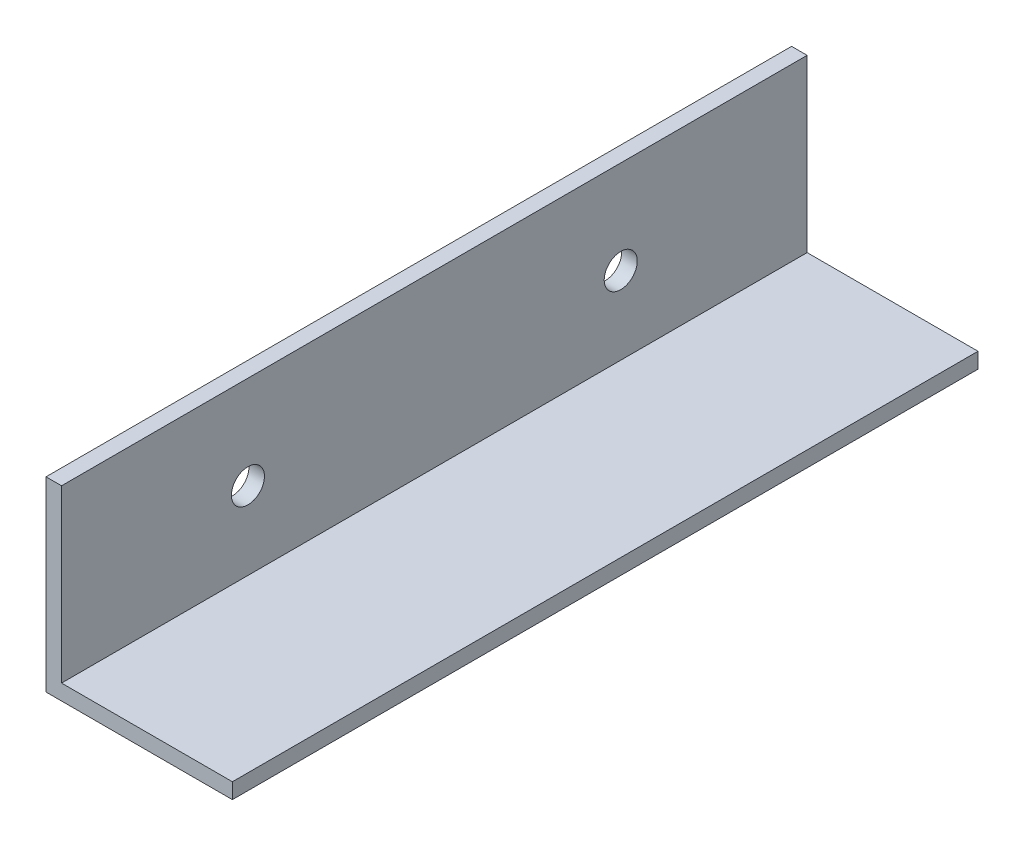
ISO-10303-21;
HEADER;
FILE_DESCRIPTION(('STEP AP214'),'2;1');
FILE_NAME('part.step','',(''),(''),'','','');
FILE_SCHEMA(('AUTOMOTIVE_DESIGN { 1 0 10303 214 1 1 1 1 }'));
ENDSEC;
DATA;
#1=APPLICATION_CONTEXT('core data for automotive mechanical design processes');
#2=APPLICATION_PROTOCOL_DEFINITION('international standard','automotive_design',2000,#1);
#3=PRODUCT_CONTEXT('',#1,'mechanical');
#4=PRODUCT('Part','Part','',(#3));
#5=PRODUCT_RELATED_PRODUCT_CATEGORY('part','',(#4));
#6=PRODUCT_DEFINITION_FORMATION('','',#4);
#7=PRODUCT_DEFINITION_CONTEXT('part definition',#1,'design');
#8=PRODUCT_DEFINITION('design','',#6,#7);
#9=PRODUCT_DEFINITION_SHAPE('','',#8);
#10=(LENGTH_UNIT() NAMED_UNIT(*) SI_UNIT(.MILLI.,.METRE.));
#11=(NAMED_UNIT(*) PLANE_ANGLE_UNIT() SI_UNIT($,.RADIAN.));
#12=(NAMED_UNIT(*) SI_UNIT($,.STERADIAN.) SOLID_ANGLE_UNIT());
#13=UNCERTAINTY_MEASURE_WITH_UNIT(LENGTH_MEASURE(1.E-05),#10,'distance_accuracy_value','');
#14=(GEOMETRIC_REPRESENTATION_CONTEXT(3) GLOBAL_UNCERTAINTY_ASSIGNED_CONTEXT((#13)) GLOBAL_UNIT_ASSIGNED_CONTEXT((#10,
#11,#12)) REPRESENTATION_CONTEXT('',''));
#15=CARTESIAN_POINT('',(0.,0.,0.));
#16=DIRECTION('',(0.,0.,1.));
#17=DIRECTION('',(1.,0.,0.));
#18=AXIS2_PLACEMENT_3D('',#15,#16,#17);
#19=CARTESIAN_POINT('',(0.,0.,152.4));
#20=DIRECTION('',(1.,0.,0.));
#21=DIRECTION('',(0.,0.,-1.));
#22=AXIS2_PLACEMENT_3D('',#19,#20,#21);
#23=PLANE('',#22);
#24=CARTESIAN_POINT('',(0.,19.05,38.1));
#25=DIRECTION('',(-1.,0.,0.));
#26=DIRECTION('',(0.,0.,1.));
#27=AXIS2_PLACEMENT_3D('',#24,#25,#26);
#28=CIRCLE('',#27,3.37819999999999);
#29=CARTESIAN_POINT('',(0.,19.05,41.4782));
#30=VERTEX_POINT('',#29);
#31=EDGE_CURVE('E157',#30,#30,#28,.T.);
#32=ORIENTED_EDGE('',*,*,#31,.F.);
#33=EDGE_LOOP('',(#32));
#34=FACE_BOUND('',#33,.T.);
#35=DIRECTION('',(0.,-1.,0.));
#36=VECTOR('',#35,1.);
#37=CARTESIAN_POINT('',(0.,0.,0.));
#38=LINE('',#37,#36);
#39=CARTESIAN_POINT('',(0.,38.1,0.));
#40=VERTEX_POINT('',#39);
#41=CARTESIAN_POINT('',(0.,0.,0.));
#42=VERTEX_POINT('',#41);
#43=EDGE_CURVE('E81',#40,#42,#38,.T.);
#44=ORIENTED_EDGE('',*,*,#43,.T.);
#45=DIRECTION('',(0.,0.,-1.));
#46=VECTOR('',#45,1.);
#47=CARTESIAN_POINT('',(0.,0.,152.4));
#48=LINE('',#47,#46);
#49=CARTESIAN_POINT('',(0.,0.,152.4));
#50=VERTEX_POINT('',#49);
#51=EDGE_CURVE('E116',#50,#42,#48,.T.);
#52=ORIENTED_EDGE('',*,*,#51,.F.);
#53=DIRECTION('',(0.,-1.,0.));
#54=VECTOR('',#53,1.);
#55=CARTESIAN_POINT('',(0.,0.,152.4));
#56=LINE('',#55,#54);
#57=CARTESIAN_POINT('',(0.,38.1,152.4));
#58=VERTEX_POINT('',#57);
#59=EDGE_CURVE('E52',#58,#50,#56,.T.);
#60=ORIENTED_EDGE('',*,*,#59,.F.);
#61=DIRECTION('',(0.,0.,-1.));
#62=VECTOR('',#61,1.);
#63=CARTESIAN_POINT('',(0.,38.1,152.4));
#64=LINE('',#63,#62);
#65=EDGE_CURVE('E112',#58,#40,#64,.T.);
#66=ORIENTED_EDGE('',*,*,#65,.T.);
#67=EDGE_LOOP('',(#44,#52,#60,#66));
#68=FACE_BOUND('',#67,.T.);
#69=CARTESIAN_POINT('',(0.,19.05,114.3));
#70=DIRECTION('',(-1.,0.,0.));
#71=DIRECTION('',(0.,0.,1.));
#72=AXIS2_PLACEMENT_3D('',#69,#70,#71);
#73=CIRCLE('',#72,3.37819999999999);
#74=CARTESIAN_POINT('',(0.,19.05,117.6782));
#75=VERTEX_POINT('',#74);
#76=EDGE_CURVE('E151',#75,#75,#73,.T.);
#77=ORIENTED_EDGE('',*,*,#76,.F.);
#78=EDGE_LOOP('',(#77));
#79=FACE_BOUND('',#78,.T.);
#80=ADVANCED_FACE('F34',(#34,#68,#79),#23,.F.);
#81=CARTESIAN_POINT('',(38.1,0.,152.4));
#82=DIRECTION('',(0.,1.,0.));
#83=DIRECTION('',(-1.,0.,0.));
#84=AXIS2_PLACEMENT_3D('',#81,#82,#83);
#85=PLANE('',#84);
#86=DIRECTION('',(1.,0.,0.));
#87=VECTOR('',#86,1.);
#88=CARTESIAN_POINT('',(38.1,0.,0.));
#89=LINE('',#88,#87);
#90=CARTESIAN_POINT('',(38.1,0.,0.));
#91=VERTEX_POINT('',#90);
#92=EDGE_CURVE('E120',#42,#91,#89,.T.);
#93=ORIENTED_EDGE('',*,*,#92,.T.);
#94=DIRECTION('',(0.,0.,-1.));
#95=VECTOR('',#94,1.);
#96=CARTESIAN_POINT('',(38.1,0.,152.4));
#97=LINE('',#96,#95);
#98=CARTESIAN_POINT('',(38.1,0.,152.4));
#99=VERTEX_POINT('',#98);
#100=EDGE_CURVE('E11',#99,#91,#97,.T.);
#101=ORIENTED_EDGE('',*,*,#100,.F.);
#102=DIRECTION('',(1.,0.,0.));
#103=VECTOR('',#102,1.);
#104=CARTESIAN_POINT('',(38.1,0.,152.4));
#105=LINE('',#104,#103);
#106=EDGE_CURVE('E131',#50,#99,#105,.T.);
#107=ORIENTED_EDGE('',*,*,#106,.F.);
#108=ORIENTED_EDGE('',*,*,#51,.T.);
#109=EDGE_LOOP('',(#93,#101,#107,#108));
#110=FACE_BOUND('',#109,.T.);
#111=ADVANCED_FACE('F36',(#110),#85,.F.);
#112=CARTESIAN_POINT('',(38.1,3.175,152.4));
#113=DIRECTION('',(-1.,0.,0.));
#114=DIRECTION('',(0.,0.,1.));
#115=AXIS2_PLACEMENT_3D('',#112,#113,#114);
#116=PLANE('',#115);
#117=DIRECTION('',(0.,1.,0.));
#118=VECTOR('',#117,1.);
#119=CARTESIAN_POINT('',(38.1,3.175,0.));
#120=LINE('',#119,#118);
#121=CARTESIAN_POINT('',(38.1,3.175,0.));
#122=VERTEX_POINT('',#121);
#123=EDGE_CURVE('E123',#91,#122,#120,.T.);
#124=ORIENTED_EDGE('',*,*,#123,.T.);
#125=DIRECTION('',(0.,0.,-1.));
#126=VECTOR('',#125,1.);
#127=CARTESIAN_POINT('',(38.1,3.175,152.4));
#128=LINE('',#127,#126);
#129=CARTESIAN_POINT('',(38.1,3.175,152.4));
#130=VERTEX_POINT('',#129);
#131=EDGE_CURVE('E44',#130,#122,#128,.T.);
#132=ORIENTED_EDGE('',*,*,#131,.F.);
#133=DIRECTION('',(0.,1.,0.));
#134=VECTOR('',#133,1.);
#135=CARTESIAN_POINT('',(38.1,3.175,152.4));
#136=LINE('',#135,#134);
#137=EDGE_CURVE('E89',#99,#130,#136,.T.);
#138=ORIENTED_EDGE('',*,*,#137,.F.);
#139=ORIENTED_EDGE('',*,*,#100,.T.);
#140=EDGE_LOOP('',(#124,#132,#138,#139));
#141=FACE_BOUND('',#140,.T.);
#142=ADVANCED_FACE('F188',(#141),#116,.F.);
#143=CARTESIAN_POINT('',(3.17500000000001,3.175,152.4));
#144=DIRECTION('',(0.,-1.,0.));
#145=DIRECTION('',(0.,0.,-1.));
#146=AXIS2_PLACEMENT_3D('',#143,#144,#145);
#147=PLANE('',#146);
#148=DIRECTION('',(-1.,0.,0.));
#149=VECTOR('',#148,1.);
#150=CARTESIAN_POINT('',(3.17500000000001,3.175,0.));
#151=LINE('',#150,#149);
#152=CARTESIAN_POINT('',(3.17500000000001,3.175,0.));
#153=VERTEX_POINT('',#152);
#154=EDGE_CURVE('E126',#122,#153,#151,.T.);
#155=ORIENTED_EDGE('',*,*,#154,.T.);
#156=DIRECTION('',(0.,0.,-1.));
#157=VECTOR('',#156,1.);
#158=CARTESIAN_POINT('',(3.17500000000001,3.175,152.4));
#159=LINE('',#158,#157);
#160=CARTESIAN_POINT('',(3.17500000000001,3.175,152.4));
#161=VERTEX_POINT('',#160);
#162=EDGE_CURVE('E111',#161,#153,#159,.T.);
#163=ORIENTED_EDGE('',*,*,#162,.F.);
#164=DIRECTION('',(-1.,0.,0.));
#165=VECTOR('',#164,1.);
#166=CARTESIAN_POINT('',(3.17500000000001,3.175,152.4));
#167=LINE('',#166,#165);
#168=EDGE_CURVE('E102',#130,#161,#167,.T.);
#169=ORIENTED_EDGE('',*,*,#168,.F.);
#170=ORIENTED_EDGE('',*,*,#131,.T.);
#171=EDGE_LOOP('',(#155,#163,#169,#170));
#172=FACE_BOUND('',#171,.T.);
#173=ADVANCED_FACE('F138',(#172),#147,.F.);
#174=CARTESIAN_POINT('',(3.175,38.1,152.4));
#175=DIRECTION('',(-1.,0.,0.));
#176=DIRECTION('',(0.,-1.,0.));
#177=AXIS2_PLACEMENT_3D('',#174,#175,#176);
#178=PLANE('',#177);
#179=CARTESIAN_POINT('',(3.175,19.05,38.1));
#180=DIRECTION('',(-1.,0.,0.));
#181=DIRECTION('',(0.,-1.,0.));
#182=AXIS2_PLACEMENT_3D('',#179,#180,#181);
#183=CIRCLE('',#182,3.37819999999999);
#184=CARTESIAN_POINT('',(3.175,15.6718,38.1));
#185=VERTEX_POINT('',#184);
#186=EDGE_CURVE('E38',#185,#185,#183,.T.);
#187=ORIENTED_EDGE('',*,*,#186,.T.);
#188=EDGE_LOOP('',(#187));
#189=FACE_BOUND('',#188,.T.);
#190=CARTESIAN_POINT('',(3.175,19.05,114.3));
#191=DIRECTION('',(-1.,0.,0.));
#192=DIRECTION('',(0.,-1.,0.));
#193=AXIS2_PLACEMENT_3D('',#190,#191,#192);
#194=CIRCLE('',#193,3.37819999999999);
#195=CARTESIAN_POINT('',(3.175,15.6718,114.3));
#196=VERTEX_POINT('',#195);
#197=EDGE_CURVE('E124',#196,#196,#194,.T.);
#198=ORIENTED_EDGE('',*,*,#197,.T.);
#199=EDGE_LOOP('',(#198));
#200=FACE_BOUND('',#199,.T.);
#201=DIRECTION('',(0.,1.,0.));
#202=VECTOR('',#201,1.);
#203=CARTESIAN_POINT('',(3.175,38.1,0.));
#204=LINE('',#203,#202);
#205=CARTESIAN_POINT('',(3.175,38.1,0.));
#206=VERTEX_POINT('',#205);
#207=EDGE_CURVE('E110',#153,#206,#204,.T.);
#208=ORIENTED_EDGE('',*,*,#207,.T.);
#209=DIRECTION('',(0.,0.,-1.));
#210=VECTOR('',#209,1.);
#211=CARTESIAN_POINT('',(3.175,38.1,152.4));
#212=LINE('',#211,#210);
#213=CARTESIAN_POINT('',(3.175,38.1,152.4));
#214=VERTEX_POINT('',#213);
#215=EDGE_CURVE('E107',#214,#206,#212,.T.);
#216=ORIENTED_EDGE('',*,*,#215,.F.);
#217=DIRECTION('',(0.,1.,0.));
#218=VECTOR('',#217,1.);
#219=CARTESIAN_POINT('',(3.175,38.1,152.4));
#220=LINE('',#219,#218);
#221=EDGE_CURVE('E96',#161,#214,#220,.T.);
#222=ORIENTED_EDGE('',*,*,#221,.F.);
#223=ORIENTED_EDGE('',*,*,#162,.T.);
#224=EDGE_LOOP('',(#208,#216,#222,#223));
#225=FACE_BOUND('',#224,.T.);
#226=ADVANCED_FACE('F108',(#189,#200,#225),#178,.F.);
#227=CARTESIAN_POINT('',(0.,38.1,152.4));
#228=DIRECTION('',(0.,-1.,0.));
#229=DIRECTION('',(0.,0.,-1.));
#230=AXIS2_PLACEMENT_3D('',#227,#228,#229);
#231=PLANE('',#230);
#232=DIRECTION('',(-1.,0.,0.));
#233=VECTOR('',#232,1.);
#234=CARTESIAN_POINT('',(0.,38.1,0.));
#235=LINE('',#234,#233);
#236=EDGE_CURVE('E75',#206,#40,#235,.T.);
#237=ORIENTED_EDGE('',*,*,#236,.T.);
#238=ORIENTED_EDGE('',*,*,#65,.F.);
#239=DIRECTION('',(-1.,0.,0.));
#240=VECTOR('',#239,1.);
#241=CARTESIAN_POINT('',(0.,38.1,152.4));
#242=LINE('',#241,#240);
#243=EDGE_CURVE('E100',#214,#58,#242,.T.);
#244=ORIENTED_EDGE('',*,*,#243,.F.);
#245=ORIENTED_EDGE('',*,*,#215,.T.);
#246=EDGE_LOOP('',(#237,#238,#244,#245));
#247=FACE_BOUND('',#246,.T.);
#248=ADVANCED_FACE('F114',(#247),#231,.F.);
#249=CARTESIAN_POINT('',(0.,0.,152.4));
#250=DIRECTION('',(0.,0.,-1.));
#251=DIRECTION('',(-1.,0.,0.));
#252=AXIS2_PLACEMENT_3D('',#249,#250,#251);
#253=PLANE('',#252);
#254=ORIENTED_EDGE('',*,*,#106,.T.);
#255=ORIENTED_EDGE('',*,*,#137,.T.);
#256=ORIENTED_EDGE('',*,*,#168,.T.);
#257=ORIENTED_EDGE('',*,*,#221,.T.);
#258=ORIENTED_EDGE('',*,*,#243,.T.);
#259=ORIENTED_EDGE('',*,*,#59,.T.);
#260=EDGE_LOOP('',(#254,#255,#256,#257,#258,#259));
#261=FACE_BOUND('',#260,.T.);
#262=ADVANCED_FACE('F98',(#261),#253,.F.);
#263=CARTESIAN_POINT('',(0.,0.,0.));
#264=DIRECTION('',(0.,0.,-1.));
#265=DIRECTION('',(-1.,0.,0.));
#266=AXIS2_PLACEMENT_3D('',#263,#264,#265);
#267=PLANE('',#266);
#268=ORIENTED_EDGE('',*,*,#92,.F.);
#269=ORIENTED_EDGE('',*,*,#43,.F.);
#270=ORIENTED_EDGE('',*,*,#236,.F.);
#271=ORIENTED_EDGE('',*,*,#207,.F.);
#272=ORIENTED_EDGE('',*,*,#154,.F.);
#273=ORIENTED_EDGE('',*,*,#123,.F.);
#274=EDGE_LOOP('',(#268,#269,#270,#271,#272,#273));
#275=FACE_BOUND('',#274,.T.);
#276=ADVANCED_FACE('F141',(#275),#267,.T.);
#277=CARTESIAN_POINT('',(0.,19.05,114.3));
#278=DIRECTION('',(-1.,0.,0.));
#279=DIRECTION('',(0.,0.,1.));
#280=AXIS2_PLACEMENT_3D('',#277,#278,#279);
#281=CYLINDRICAL_SURFACE('',#280,3.37819999999999);
#282=ORIENTED_EDGE('',*,*,#76,.T.);
#283=EDGE_LOOP('',(#282));
#284=FACE_BOUND('',#283,.T.);
#285=ORIENTED_EDGE('',*,*,#197,.F.);
#286=EDGE_LOOP('',(#285));
#287=FACE_BOUND('',#286,.T.);
#288=ADVANCED_FACE('F167',(#284,#287),#281,.F.);
#289=CARTESIAN_POINT('',(0.,19.05,38.1));
#290=DIRECTION('',(-1.,0.,0.));
#291=DIRECTION('',(0.,0.,1.));
#292=AXIS2_PLACEMENT_3D('',#289,#290,#291);
#293=CYLINDRICAL_SURFACE('',#292,3.37819999999999);
#294=ORIENTED_EDGE('',*,*,#31,.T.);
#295=EDGE_LOOP('',(#294));
#296=FACE_BOUND('',#295,.T.);
#297=ORIENTED_EDGE('',*,*,#186,.F.);
#298=EDGE_LOOP('',(#297));
#299=FACE_BOUND('',#298,.T.);
#300=ADVANCED_FACE('F164',(#296,#299),#293,.F.);
#301=CLOSED_SHELL('',(#80,#111,#142,#173,#226,#248,#262,#276,#288,#300));
#302=MANIFOLD_SOLID_BREP('B2',#301);
#303=ADVANCED_BREP_SHAPE_REPRESENTATION('',(#18,#302),#14);
#304=SHAPE_DEFINITION_REPRESENTATION(#9,#303);
ENDSEC;
END-ISO-10303-21;
